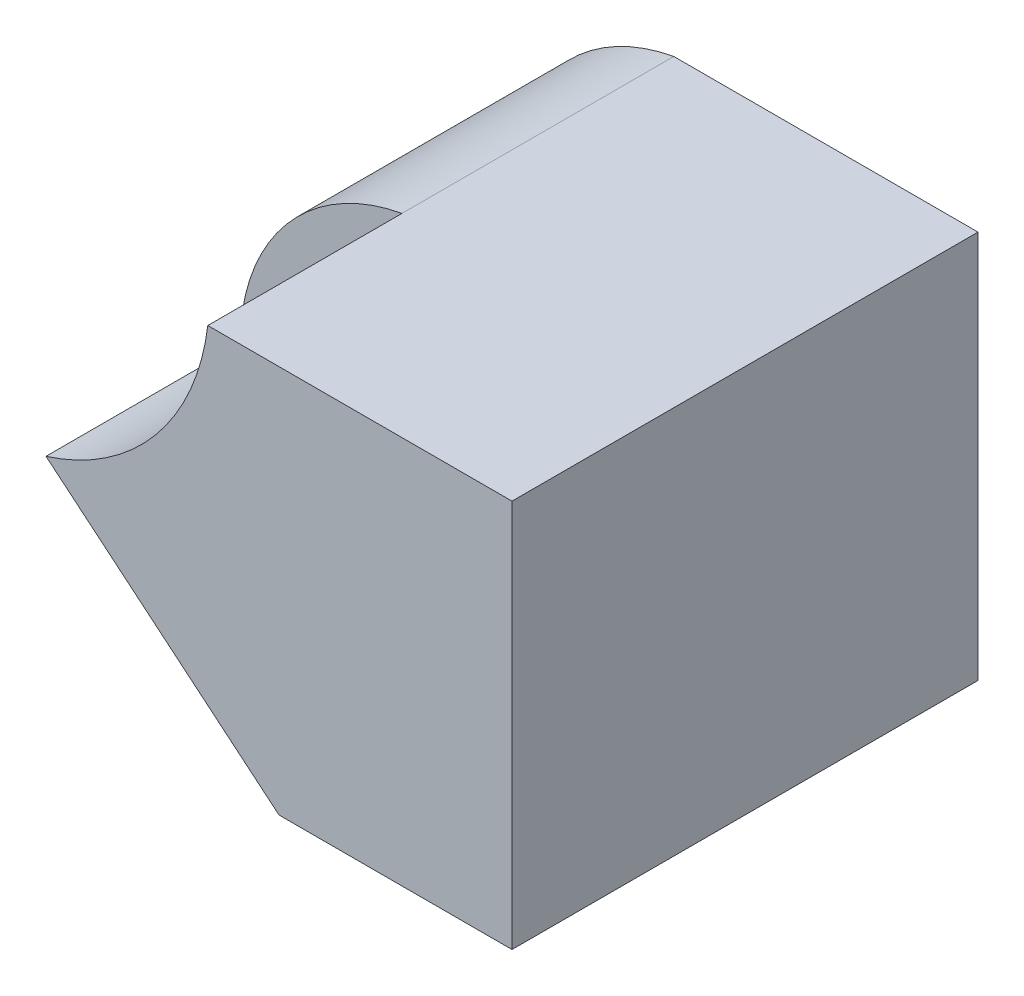
ISO-10303-21;
HEADER;
FILE_DESCRIPTION(('STEP AP214'),'2;1');
FILE_NAME('part.step','',(''),(''),'','','');
FILE_SCHEMA(('AUTOMOTIVE_DESIGN { 1 0 10303 214 1 1 1 1 }'));
ENDSEC;
DATA;
#1=APPLICATION_CONTEXT('core data for automotive mechanical design processes');
#2=APPLICATION_PROTOCOL_DEFINITION('international standard','automotive_design',2000,#1);
#3=PRODUCT_CONTEXT('',#1,'mechanical');
#4=PRODUCT('Part','Part','',(#3));
#5=PRODUCT_RELATED_PRODUCT_CATEGORY('part','',(#4));
#6=PRODUCT_DEFINITION_FORMATION('','',#4);
#7=PRODUCT_DEFINITION_CONTEXT('part definition',#1,'design');
#8=PRODUCT_DEFINITION('design','',#6,#7);
#9=PRODUCT_DEFINITION_SHAPE('','',#8);
#10=(LENGTH_UNIT() NAMED_UNIT(*) SI_UNIT(.MILLI.,.METRE.));
#11=(NAMED_UNIT(*) PLANE_ANGLE_UNIT() SI_UNIT($,.RADIAN.));
#12=(NAMED_UNIT(*) SI_UNIT($,.STERADIAN.) SOLID_ANGLE_UNIT());
#13=UNCERTAINTY_MEASURE_WITH_UNIT(LENGTH_MEASURE(1.E-05),#10,'distance_accuracy_value','');
#14=(GEOMETRIC_REPRESENTATION_CONTEXT(3) GLOBAL_UNCERTAINTY_ASSIGNED_CONTEXT((#13)) GLOBAL_UNIT_ASSIGNED_CONTEXT((#10,
#11,#12)) REPRESENTATION_CONTEXT('',''));
#15=CARTESIAN_POINT('',(0.,0.,0.));
#16=DIRECTION('',(0.,0.,1.));
#17=DIRECTION('',(1.,0.,0.));
#18=AXIS2_PLACEMENT_3D('',#15,#16,#17);
#19=CARTESIAN_POINT('',(-3.,5.,3.));
#20=DIRECTION('',(0.,0.,-1.));
#21=DIRECTION('',(-1.,0.,0.));
#22=AXIS2_PLACEMENT_3D('',#19,#20,#21);
#23=PLANE('',#22);
#24=DIRECTION('',(0.768221279597376,-0.64018439966448,0.));
#25=VECTOR('',#24,1.);
#26=CARTESIAN_POINT('',(0.,0.,3.));
#27=LINE('',#26,#25);
#28=CARTESIAN_POINT('',(-3.,2.5,3.));
#29=VERTEX_POINT('',#28);
#30=CARTESIAN_POINT('',(0.,0.,3.));
#31=VERTEX_POINT('',#30);
#32=EDGE_CURVE('E110',#29,#31,#27,.T.);
#33=ORIENTED_EDGE('',*,*,#32,.T.);
#34=DIRECTION('',(1.,0.,0.));
#35=VECTOR('',#34,1.);
#36=CARTESIAN_POINT('',(-3.,0.,3.));
#37=LINE('',#36,#35);
#38=CARTESIAN_POINT('',(3.,0.,3.));
#39=VERTEX_POINT('',#38);
#40=EDGE_CURVE('E103',#31,#39,#37,.T.);
#41=ORIENTED_EDGE('',*,*,#40,.T.);
#42=DIRECTION('',(0.,-1.,0.));
#43=VECTOR('',#42,1.);
#44=CARTESIAN_POINT('',(3.,5.,3.));
#45=LINE('',#44,#43);
#46=CARTESIAN_POINT('',(3.,5.,3.));
#47=VERTEX_POINT('',#46);
#48=EDGE_CURVE('E105',#47,#39,#45,.T.);
#49=ORIENTED_EDGE('',*,*,#48,.F.);
#50=DIRECTION('',(1.,0.,0.));
#51=VECTOR('',#50,1.);
#52=CARTESIAN_POINT('',(-3.,5.,3.));
#53=LINE('',#52,#51);
#54=CARTESIAN_POINT('',(-0.916666666666668,5.,3.));
#55=VERTEX_POINT('',#54);
#56=EDGE_CURVE('E89',#55,#47,#53,.T.);
#57=ORIENTED_EDGE('',*,*,#56,.F.);
#58=CARTESIAN_POINT('',(-3.89456044032158,5.36352258915687,3.));
#59=DIRECTION('',(0.,0.,1.));
#60=DIRECTION('',(1.,0.,0.));
#61=AXIS2_PLACEMENT_3D('',#58,#59,#60);
#62=CIRCLE('',#61,3.);
#63=EDGE_CURVE('E157',#29,#55,#62,.T.);
#64=ORIENTED_EDGE('',*,*,#63,.F.);
#65=EDGE_LOOP('',(#33,#41,#49,#57,#64));
#66=FACE_BOUND('',#65,.T.);
#67=ADVANCED_FACE('F66',(#66),#23,.F.);
#68=CARTESIAN_POINT('',(0.,0.,0.));
#69=DIRECTION('',(0.,-1.,0.));
#70=DIRECTION('',(0.,0.,-1.));
#71=AXIS2_PLACEMENT_3D('',#68,#69,#70);
#72=PLANE('',#71);
#73=ORIENTED_EDGE('',*,*,#40,.F.);
#74=DIRECTION('',(0.,0.,1.));
#75=VECTOR('',#74,1.);
#76=CARTESIAN_POINT('',(0.,0.,0.5));
#77=LINE('',#76,#75);
#78=CARTESIAN_POINT('',(0.,0.,0.5));
#79=VERTEX_POINT('',#78);
#80=EDGE_CURVE('E159',#79,#31,#77,.T.);
#81=ORIENTED_EDGE('',*,*,#80,.F.);
#82=DIRECTION('',(1.,0.,0.));
#83=VECTOR('',#82,1.);
#84=CARTESIAN_POINT('',(0.,0.,0.5));
#85=LINE('',#84,#83);
#86=CARTESIAN_POINT('',(-0.916666666666668,0.,0.5));
#87=VERTEX_POINT('',#86);
#88=EDGE_CURVE('E164',#87,#79,#85,.T.);
#89=ORIENTED_EDGE('',*,*,#88,.F.);
#90=DIRECTION('',(0.,0.,1.));
#91=VECTOR('',#90,1.);
#92=CARTESIAN_POINT('',(-0.916666666666668,0.,-7.));
#93=LINE('',#92,#91);
#94=CARTESIAN_POINT('',(-0.916666666666668,0.,-3.));
#95=VERTEX_POINT('',#94);
#96=EDGE_CURVE('E12',#87,#95,#93,.F.);
#97=ORIENTED_EDGE('',*,*,#96,.T.);
#98=DIRECTION('',(-1.,0.,0.));
#99=VECTOR('',#98,1.);
#100=CARTESIAN_POINT('',(-3.,0.,-3.));
#101=LINE('',#100,#99);
#102=CARTESIAN_POINT('',(3.,0.,-3.));
#103=VERTEX_POINT('',#102);
#104=EDGE_CURVE('E115',#103,#95,#101,.T.);
#105=ORIENTED_EDGE('',*,*,#104,.F.);
#106=DIRECTION('',(0.,0.,-1.));
#107=VECTOR('',#106,1.);
#108=CARTESIAN_POINT('',(3.,0.,3.));
#109=LINE('',#108,#107);
#110=EDGE_CURVE('E120',#39,#103,#109,.T.);
#111=ORIENTED_EDGE('',*,*,#110,.F.);
#112=EDGE_LOOP('',(#73,#81,#89,#97,#105,#111));
#113=FACE_BOUND('',#112,.T.);
#114=ADVANCED_FACE('F123',(#113),#72,.T.);
#115=CARTESIAN_POINT('',(-0.458333333333334,2.5,-7.));
#116=DIRECTION('',(0.,0.,1.));
#117=DIRECTION('',(1.,0.,0.));
#118=AXIS2_PLACEMENT_3D('',#115,#116,#117);
#119=CYLINDRICAL_SURFACE('',#118,2.54166666666667);
#120=ORIENTED_EDGE('',*,*,#96,.F.);
#121=CARTESIAN_POINT('',(-0.458333333333334,2.5,0.5));
#122=DIRECTION('',(0.,0.,1.));
#123=DIRECTION('',(1.,0.,0.));
#124=AXIS2_PLACEMENT_3D('',#121,#122,#123);
#125=CIRCLE('',#124,2.54166666666667);
#126=CARTESIAN_POINT('',(-3.,2.5,0.5));
#127=VERTEX_POINT('',#126);
#128=EDGE_CURVE('E169',#127,#87,#125,.T.);
#129=ORIENTED_EDGE('',*,*,#128,.F.);
#130=CARTESIAN_POINT('',(-0.458333333333334,2.5,0.5));
#131=DIRECTION('',(0.,0.,1.));
#132=DIRECTION('',(1.,0.,0.));
#133=AXIS2_PLACEMENT_3D('',#130,#131,#132);
#134=CIRCLE('',#133,2.54166666666667);
#135=CARTESIAN_POINT('',(-0.916666666666668,5.,0.5));
#136=VERTEX_POINT('',#135);
#137=EDGE_CURVE('E147',#136,#127,#134,.T.);
#138=ORIENTED_EDGE('',*,*,#137,.F.);
#139=DIRECTION('',(0.,0.,1.));
#140=VECTOR('',#139,1.);
#141=CARTESIAN_POINT('',(-0.916666666666668,5.,-7.));
#142=LINE('',#141,#140);
#143=CARTESIAN_POINT('',(-0.916666666666668,5.,-3.));
#144=VERTEX_POINT('',#143);
#145=EDGE_CURVE('E135',#136,#144,#142,.F.);
#146=ORIENTED_EDGE('',*,*,#145,.T.);
#147=CARTESIAN_POINT('',(-0.458333333333334,2.5,-3.));
#148=DIRECTION('',(0.,0.,1.));
#149=DIRECTION('',(1.,0.,0.));
#150=AXIS2_PLACEMENT_3D('',#147,#148,#149);
#151=CIRCLE('',#150,2.54166666666667);
#152=EDGE_CURVE('E126',#144,#95,#151,.T.);
#153=ORIENTED_EDGE('',*,*,#152,.T.);
#154=EDGE_LOOP('',(#120,#129,#138,#146,#153));
#155=FACE_BOUND('',#154,.T.);
#156=ADVANCED_FACE('F144',(#155),#119,.T.);
#157=CARTESIAN_POINT('',(-3.,5.,-3.));
#158=DIRECTION('',(0.,0.,1.));
#159=DIRECTION('',(1.,0.,0.));
#160=AXIS2_PLACEMENT_3D('',#157,#158,#159);
#161=PLANE('',#160);
#162=ORIENTED_EDGE('',*,*,#104,.T.);
#163=ORIENTED_EDGE('',*,*,#152,.F.);
#164=DIRECTION('',(-1.,0.,0.));
#165=VECTOR('',#164,1.);
#166=CARTESIAN_POINT('',(-3.,5.,-3.));
#167=LINE('',#166,#165);
#168=CARTESIAN_POINT('',(3.,5.,-3.));
#169=VERTEX_POINT('',#168);
#170=EDGE_CURVE('E151',#169,#144,#167,.T.);
#171=ORIENTED_EDGE('',*,*,#170,.F.);
#172=DIRECTION('',(0.,-1.,0.));
#173=VECTOR('',#172,1.);
#174=CARTESIAN_POINT('',(3.,5.,-3.));
#175=LINE('',#174,#173);
#176=EDGE_CURVE('E121',#169,#103,#175,.T.);
#177=ORIENTED_EDGE('',*,*,#176,.T.);
#178=EDGE_LOOP('',(#162,#163,#171,#177));
#179=FACE_BOUND('',#178,.T.);
#180=ADVANCED_FACE('F150',(#179),#161,.F.);
#181=CARTESIAN_POINT('',(0.,5.,0.));
#182=DIRECTION('',(0.,-1.,0.));
#183=DIRECTION('',(0.,0.,-1.));
#184=AXIS2_PLACEMENT_3D('',#181,#182,#183);
#185=PLANE('',#184);
#186=EDGE_CURVE('E74',#55,#136,#142,.F.);
#187=ORIENTED_EDGE('',*,*,#186,.F.);
#188=ORIENTED_EDGE('',*,*,#56,.T.);
#189=DIRECTION('',(0.,0.,-1.));
#190=VECTOR('',#189,1.);
#191=CARTESIAN_POINT('',(3.,5.,3.));
#192=LINE('',#191,#190);
#193=EDGE_CURVE('E114',#47,#169,#192,.T.);
#194=ORIENTED_EDGE('',*,*,#193,.T.);
#195=ORIENTED_EDGE('',*,*,#170,.T.);
#196=ORIENTED_EDGE('',*,*,#145,.F.);
#197=EDGE_LOOP('',(#187,#188,#194,#195,#196));
#198=FACE_BOUND('',#197,.T.);
#199=ADVANCED_FACE('F152',(#198),#185,.F.);
#200=CARTESIAN_POINT('',(3.,5.,3.));
#201=DIRECTION('',(-1.,0.,0.));
#202=DIRECTION('',(0.,0.,1.));
#203=AXIS2_PLACEMENT_3D('',#200,#201,#202);
#204=PLANE('',#203);
#205=ORIENTED_EDGE('',*,*,#110,.T.);
#206=ORIENTED_EDGE('',*,*,#176,.F.);
#207=ORIENTED_EDGE('',*,*,#193,.F.);
#208=ORIENTED_EDGE('',*,*,#48,.T.);
#209=EDGE_LOOP('',(#205,#206,#207,#208));
#210=FACE_BOUND('',#209,.T.);
#211=ADVANCED_FACE('F68',(#210),#204,.F.);
#212=CARTESIAN_POINT('',(-3.89456044032158,5.36352258915687,0.5));
#213=DIRECTION('',(0.,0.,1.));
#214=DIRECTION('',(1.,0.,0.));
#215=AXIS2_PLACEMENT_3D('',#212,#213,#214);
#216=CYLINDRICAL_SURFACE('',#215,3.);
#217=ORIENTED_EDGE('',*,*,#63,.T.);
#218=ORIENTED_EDGE('',*,*,#186,.T.);
#219=CARTESIAN_POINT('',(-3.89456044032158,5.36352258915687,0.5));
#220=DIRECTION('',(0.,0.,1.));
#221=DIRECTION('',(1.,0.,0.));
#222=AXIS2_PLACEMENT_3D('',#219,#220,#221);
#223=CIRCLE('',#222,3.);
#224=EDGE_CURVE('E80',#127,#136,#223,.T.);
#225=ORIENTED_EDGE('',*,*,#224,.F.);
#226=DIRECTION('',(0.,0.,1.));
#227=VECTOR('',#226,1.);
#228=CARTESIAN_POINT('',(-3.,2.5,0.5));
#229=LINE('',#228,#227);
#230=EDGE_CURVE('E130',#127,#29,#229,.T.);
#231=ORIENTED_EDGE('',*,*,#230,.T.);
#232=EDGE_LOOP('',(#217,#218,#225,#231));
#233=FACE_BOUND('',#232,.T.);
#234=ADVANCED_FACE('F188',(#233),#216,.F.);
#235=CARTESIAN_POINT('',(0.,0.,0.5));
#236=DIRECTION('',(0.,0.,1.));
#237=DIRECTION('',(1.,0.,0.));
#238=AXIS2_PLACEMENT_3D('',#235,#236,#237);
#239=PLANE('',#238);
#240=ORIENTED_EDGE('',*,*,#137,.T.);
#241=ORIENTED_EDGE('',*,*,#224,.T.);
#242=EDGE_LOOP('',(#240,#241));
#243=FACE_BOUND('',#242,.T.);
#244=ADVANCED_FACE('F187',(#243),#239,.T.);
#245=CARTESIAN_POINT('',(0.,0.,0.5));
#246=DIRECTION('',(-0.64018439966448,-0.768221279597376,0.));
#247=DIRECTION('',(0.768221279597376,-0.64018439966448,0.));
#248=AXIS2_PLACEMENT_3D('',#245,#246,#247);
#249=PLANE('',#248);
#250=ORIENTED_EDGE('',*,*,#32,.F.);
#251=ORIENTED_EDGE('',*,*,#230,.F.);
#252=DIRECTION('',(0.768221279597376,-0.64018439966448,0.));
#253=VECTOR('',#252,1.);
#254=CARTESIAN_POINT('',(0.,0.,0.5));
#255=LINE('',#254,#253);
#256=EDGE_CURVE('E166',#127,#79,#255,.T.);
#257=ORIENTED_EDGE('',*,*,#256,.T.);
#258=ORIENTED_EDGE('',*,*,#80,.T.);
#259=EDGE_LOOP('',(#250,#251,#257,#258));
#260=FACE_BOUND('',#259,.T.);
#261=ADVANCED_FACE('F177',(#260),#249,.T.);
#262=CARTESIAN_POINT('',(0.,0.,0.5));
#263=DIRECTION('',(0.,0.,1.));
#264=DIRECTION('',(1.,0.,0.));
#265=AXIS2_PLACEMENT_3D('',#262,#263,#264);
#266=PLANE('',#265);
#267=ORIENTED_EDGE('',*,*,#256,.F.);
#268=ORIENTED_EDGE('',*,*,#128,.T.);
#269=ORIENTED_EDGE('',*,*,#88,.T.);
#270=EDGE_LOOP('',(#267,#268,#269));
#271=FACE_BOUND('',#270,.T.);
#272=ADVANCED_FACE('F184',(#271),#266,.T.);
#273=CLOSED_SHELL('',(#67,#114,#156,#180,#199,#211,#234,#244,#261,#272));
#274=MANIFOLD_SOLID_BREP('B2',#273);
#275=ADVANCED_BREP_SHAPE_REPRESENTATION('',(#18,#274),#14);
#276=SHAPE_DEFINITION_REPRESENTATION(#9,#275);
ENDSEC;
END-ISO-10303-21;
